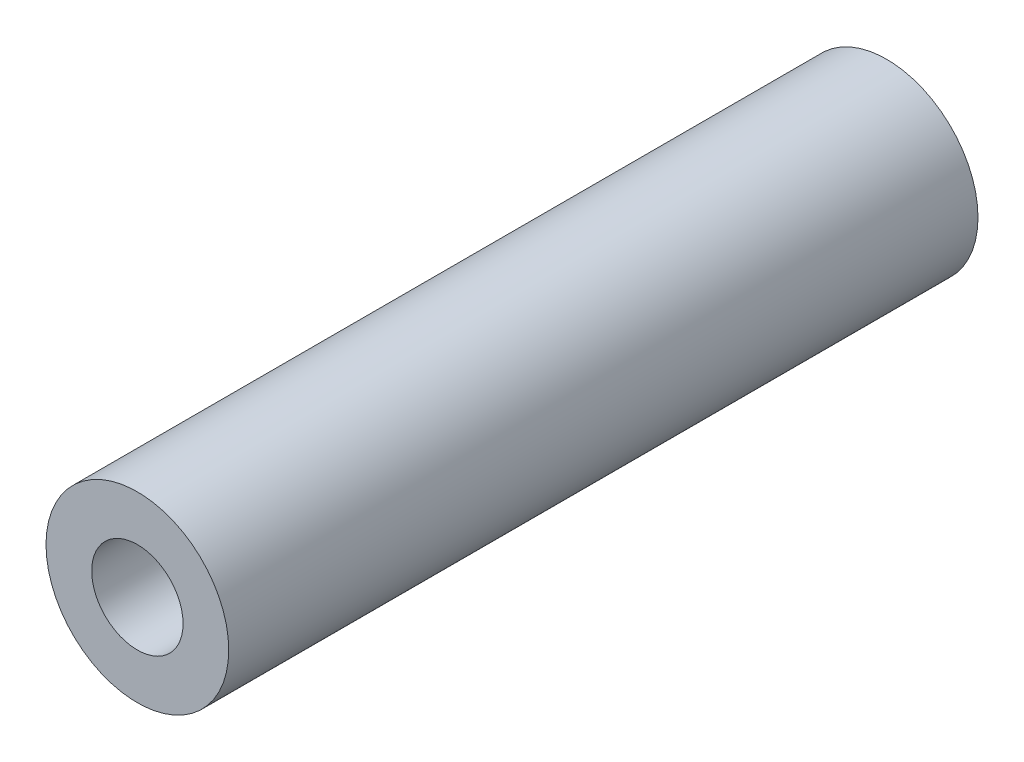
ISO-10303-21;
HEADER;
FILE_DESCRIPTION(('STEP AP214'),'2;1');
FILE_NAME('part.step','',(''),(''),'','','');
FILE_SCHEMA(('AUTOMOTIVE_DESIGN { 1 0 10303 214 1 1 1 1 }'));
ENDSEC;
DATA;
#1=APPLICATION_CONTEXT('core data for automotive mechanical design processes');
#2=APPLICATION_PROTOCOL_DEFINITION('international standard','automotive_design',2000,#1);
#3=PRODUCT_CONTEXT('',#1,'mechanical');
#4=PRODUCT('Part','Part','',(#3));
#5=PRODUCT_RELATED_PRODUCT_CATEGORY('part','',(#4));
#6=PRODUCT_DEFINITION_FORMATION('','',#4);
#7=PRODUCT_DEFINITION_CONTEXT('part definition',#1,'design');
#8=PRODUCT_DEFINITION('design','',#6,#7);
#9=PRODUCT_DEFINITION_SHAPE('','',#8);
#10=(LENGTH_UNIT() NAMED_UNIT(*) SI_UNIT(.MILLI.,.METRE.));
#11=(NAMED_UNIT(*) PLANE_ANGLE_UNIT() SI_UNIT($,.RADIAN.));
#12=(NAMED_UNIT(*) SI_UNIT($,.STERADIAN.) SOLID_ANGLE_UNIT());
#13=UNCERTAINTY_MEASURE_WITH_UNIT(LENGTH_MEASURE(1.E-05),#10,'distance_accuracy_value','');
#14=(GEOMETRIC_REPRESENTATION_CONTEXT(3) GLOBAL_UNCERTAINTY_ASSIGNED_CONTEXT((#13)) GLOBAL_UNIT_ASSIGNED_CONTEXT((#10,
#11,#12)) REPRESENTATION_CONTEXT('',''));
#15=CARTESIAN_POINT('',(0.,0.,0.));
#16=DIRECTION('',(0.,0.,1.));
#17=DIRECTION('',(1.,0.,0.));
#18=AXIS2_PLACEMENT_3D('',#15,#16,#17);
#19=CARTESIAN_POINT('',(0.,0.,52.07));
#20=DIRECTION('',(0.,0.,1.));
#21=DIRECTION('',(1.,0.,0.));
#22=AXIS2_PLACEMENT_3D('',#19,#20,#21);
#23=PLANE('',#22);
#24=CARTESIAN_POINT('',(0.,0.,52.07));
#25=DIRECTION('',(0.,0.,1.));
#26=DIRECTION('',(1.,0.,0.));
#27=AXIS2_PLACEMENT_3D('',#24,#25,#26);
#28=CIRCLE('',#27,6.35);
#29=CARTESIAN_POINT('',(6.35,0.,52.07));
#30=VERTEX_POINT('',#29);
#31=EDGE_CURVE('E10',#30,#30,#28,.T.);
#32=ORIENTED_EDGE('',*,*,#31,.T.);
#33=EDGE_LOOP('',(#32));
#34=FACE_BOUND('',#33,.T.);
#35=CARTESIAN_POINT('',(0.,0.,52.07));
#36=DIRECTION('',(0.,0.,1.));
#37=DIRECTION('',(1.,0.,0.));
#38=AXIS2_PLACEMENT_3D('',#35,#36,#37);
#39=CIRCLE('',#38,3.175);
#40=CARTESIAN_POINT('',(3.175,0.,52.07));
#41=VERTEX_POINT('',#40);
#42=EDGE_CURVE('E43',#41,#41,#39,.T.);
#43=ORIENTED_EDGE('',*,*,#42,.F.);
#44=EDGE_LOOP('',(#43));
#45=FACE_BOUND('',#44,.T.);
#46=ADVANCED_FACE('F32',(#34,#45),#23,.T.);
#47=CARTESIAN_POINT('',(0.,0.,0.));
#48=DIRECTION('',(0.,0.,1.));
#49=DIRECTION('',(1.,0.,0.));
#50=AXIS2_PLACEMENT_3D('',#47,#48,#49);
#51=PLANE('',#50);
#52=CARTESIAN_POINT('',(0.,0.,0.));
#53=DIRECTION('',(0.,0.,1.));
#54=DIRECTION('',(1.,0.,0.));
#55=AXIS2_PLACEMENT_3D('',#52,#53,#54);
#56=CIRCLE('',#55,6.35);
#57=CARTESIAN_POINT('',(6.35,0.,0.));
#58=VERTEX_POINT('',#57);
#59=EDGE_CURVE('E36',#58,#58,#56,.T.);
#60=ORIENTED_EDGE('',*,*,#59,.F.);
#61=EDGE_LOOP('',(#60));
#62=FACE_BOUND('',#61,.T.);
#63=CARTESIAN_POINT('',(0.,0.,0.));
#64=DIRECTION('',(0.,0.,1.));
#65=DIRECTION('',(1.,0.,0.));
#66=AXIS2_PLACEMENT_3D('',#63,#64,#65);
#67=CIRCLE('',#66,3.175);
#68=CARTESIAN_POINT('',(3.175,0.,0.));
#69=VERTEX_POINT('',#68);
#70=EDGE_CURVE('E45',#69,#69,#67,.T.);
#71=ORIENTED_EDGE('',*,*,#70,.T.);
#72=EDGE_LOOP('',(#71));
#73=FACE_BOUND('',#72,.T.);
#74=ADVANCED_FACE('F55',(#62,#73),#51,.F.);
#75=CARTESIAN_POINT('',(0.,0.,52.07));
#76=DIRECTION('',(0.,0.,-1.));
#77=DIRECTION('',(-1.,0.,0.));
#78=AXIS2_PLACEMENT_3D('',#75,#76,#77);
#79=CYLINDRICAL_SURFACE('',#78,6.35);
#80=ORIENTED_EDGE('',*,*,#31,.F.);
#81=EDGE_LOOP('',(#80));
#82=FACE_BOUND('',#81,.T.);
#83=ORIENTED_EDGE('',*,*,#59,.T.);
#84=EDGE_LOOP('',(#83));
#85=FACE_BOUND('',#84,.T.);
#86=ADVANCED_FACE('F34',(#82,#85),#79,.T.);
#87=CARTESIAN_POINT('',(0.,0.,52.07));
#88=DIRECTION('',(0.,0.,-1.));
#89=DIRECTION('',(-1.,0.,0.));
#90=AXIS2_PLACEMENT_3D('',#87,#88,#89);
#91=CYLINDRICAL_SURFACE('',#90,3.175);
#92=ORIENTED_EDGE('',*,*,#42,.T.);
#93=EDGE_LOOP('',(#92));
#94=FACE_BOUND('',#93,.T.);
#95=ORIENTED_EDGE('',*,*,#70,.F.);
#96=EDGE_LOOP('',(#95));
#97=FACE_BOUND('',#96,.T.);
#98=ADVANCED_FACE('F51',(#94,#97),#91,.F.);
#99=CLOSED_SHELL('',(#46,#74,#86,#98));
#100=MANIFOLD_SOLID_BREP('B2',#99);
#101=ADVANCED_BREP_SHAPE_REPRESENTATION('',(#18,#100),#14);
#102=SHAPE_DEFINITION_REPRESENTATION(#9,#101);
ENDSEC;
END-ISO-10303-21;
